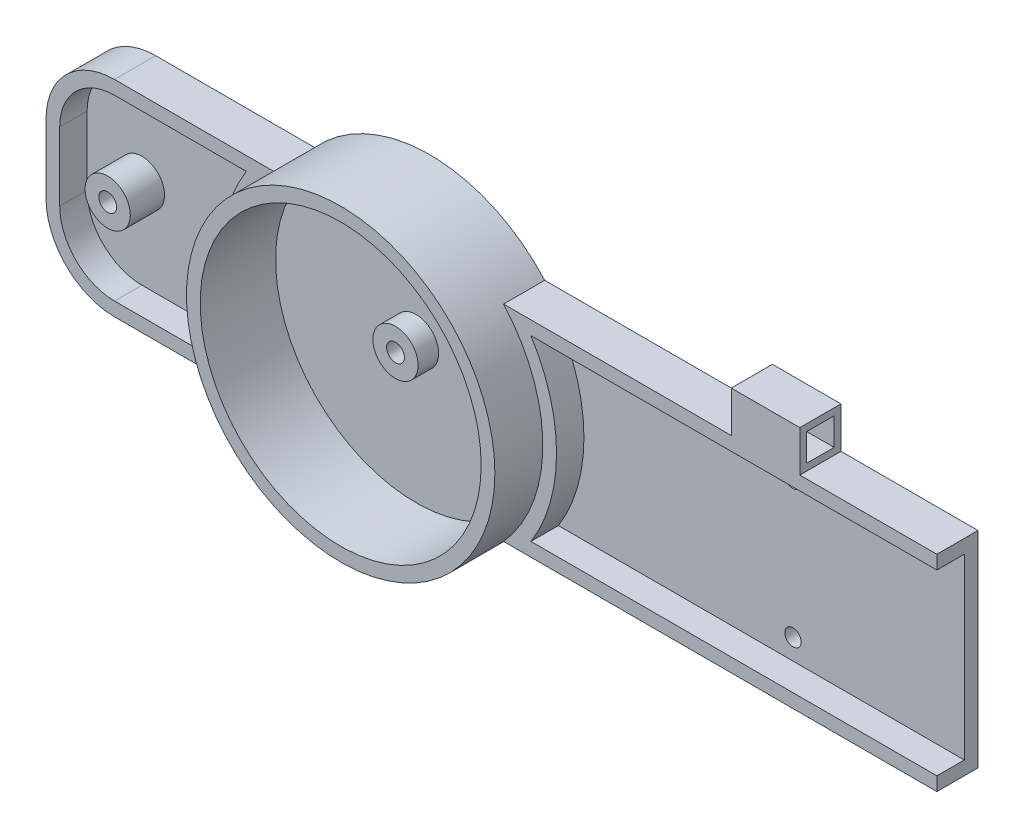
ISO-10303-21;
HEADER;
FILE_DESCRIPTION(('STEP AP214'),'2;1');
FILE_NAME('part.step','',(''),(''),'','','');
FILE_SCHEMA(('AUTOMOTIVE_DESIGN { 1 0 10303 214 1 1 1 1 }'));
ENDSEC;
DATA;
#1=APPLICATION_CONTEXT('core data for automotive mechanical design processes');
#2=APPLICATION_PROTOCOL_DEFINITION('international standard','automotive_design',2000,#1);
#3=PRODUCT_CONTEXT('',#1,'mechanical');
#4=PRODUCT('Part','Part','',(#3));
#5=PRODUCT_RELATED_PRODUCT_CATEGORY('part','',(#4));
#6=PRODUCT_DEFINITION_FORMATION('','',#4);
#7=PRODUCT_DEFINITION_CONTEXT('part definition',#1,'design');
#8=PRODUCT_DEFINITION('design','',#6,#7);
#9=PRODUCT_DEFINITION_SHAPE('','',#8);
#10=(LENGTH_UNIT() NAMED_UNIT(*) SI_UNIT(.MILLI.,.METRE.));
#11=(NAMED_UNIT(*) PLANE_ANGLE_UNIT() SI_UNIT($,.RADIAN.));
#12=(NAMED_UNIT(*) SI_UNIT($,.STERADIAN.) SOLID_ANGLE_UNIT());
#13=UNCERTAINTY_MEASURE_WITH_UNIT(LENGTH_MEASURE(1.E-05),#10,'distance_accuracy_value','');
#14=(GEOMETRIC_REPRESENTATION_CONTEXT(3) GLOBAL_UNCERTAINTY_ASSIGNED_CONTEXT((#13)) GLOBAL_UNIT_ASSIGNED_CONTEXT((#10,
#11,#12)) REPRESENTATION_CONTEXT('',''));
#15=CARTESIAN_POINT('',(0.,0.,0.));
#16=DIRECTION('',(0.,0.,1.));
#17=DIRECTION('',(1.,0.,0.));
#18=AXIS2_PLACEMENT_3D('',#15,#16,#17);
#19=CARTESIAN_POINT('',(-50.,15.,6.));
#20=DIRECTION('',(0.,-1.,0.));
#21=DIRECTION('',(0.,0.,-1.));
#22=AXIS2_PLACEMENT_3D('',#19,#20,#21);
#23=PLANE('',#22);
#24=DIRECTION('',(0.,0.,1.));
#25=VECTOR('',#24,1.);
#26=CARTESIAN_POINT('',(80.,15.,6.));
#27=LINE('',#26,#25);
#28=CARTESIAN_POINT('',(80.,15.,0.));
#29=VERTEX_POINT('',#28);
#30=CARTESIAN_POINT('',(80.,15.,6.));
#31=VERTEX_POINT('',#30);
#32=EDGE_CURVE('E61',#29,#31,#27,.T.);
#33=ORIENTED_EDGE('',*,*,#32,.F.);
#34=DIRECTION('',(-1.,0.,0.));
#35=VECTOR('',#34,1.);
#36=CARTESIAN_POINT('',(-50.,15.,0.));
#37=LINE('',#36,#35);
#38=CARTESIAN_POINT('',(60.,15.,0.));
#39=VERTEX_POINT('',#38);
#40=EDGE_CURVE('E447',#29,#39,#37,.T.);
#41=ORIENTED_EDGE('',*,*,#40,.T.);
#42=DIRECTION('',(0.,0.,-1.));
#43=VECTOR('',#42,1.);
#44=CARTESIAN_POINT('',(60.,15.,6.));
#45=LINE('',#44,#43);
#46=CARTESIAN_POINT('',(60.,15.,6.));
#47=VERTEX_POINT('',#46);
#48=EDGE_CURVE('E323',#47,#39,#45,.T.);
#49=ORIENTED_EDGE('',*,*,#48,.F.);
#50=DIRECTION('',(-1.,0.,0.));
#51=VECTOR('',#50,1.);
#52=CARTESIAN_POINT('',(-50.,15.,6.));
#53=LINE('',#52,#51);
#54=EDGE_CURVE('E437',#31,#47,#53,.T.);
#55=ORIENTED_EDGE('',*,*,#54,.F.);
#56=EDGE_LOOP('',(#33,#41,#49,#55));
#57=FACE_BOUND('',#56,.T.);
#58=ADVANCED_FACE('F46',(#57),#23,.F.);
#59=CARTESIAN_POINT('',(0.,0.,0.));
#60=DIRECTION('',(0.,0.,1.));
#61=DIRECTION('',(1.,0.,0.));
#62=AXIS2_PLACEMENT_3D('',#59,#60,#61);
#63=PLANE('',#62);
#64=CARTESIAN_POINT('',(0.,0.,0.));
#65=DIRECTION('',(0.,0.,-1.));
#66=DIRECTION('',(-1.,0.,0.));
#67=AXIS2_PLACEMENT_3D('',#64,#65,#66);
#68=CIRCLE('',#67,1.3);
#69=CARTESIAN_POINT('',(-1.3,0.,0.));
#70=VERTEX_POINT('',#69);
#71=EDGE_CURVE('E355',#70,#70,#68,.T.);
#72=ORIENTED_EDGE('',*,*,#71,.F.);
#73=EDGE_LOOP('',(#72));
#74=FACE_BOUND('',#73,.T.);
#75=CARTESIAN_POINT('',(-40.,0.,0.));
#76=DIRECTION('',(0.,0.,-1.));
#77=DIRECTION('',(-1.,0.,0.));
#78=AXIS2_PLACEMENT_3D('',#75,#76,#77);
#79=CIRCLE('',#78,1.29999999999999);
#80=CARTESIAN_POINT('',(-41.3,0.,0.));
#81=VERTEX_POINT('',#80);
#82=EDGE_CURVE('E344',#81,#81,#79,.T.);
#83=ORIENTED_EDGE('',*,*,#82,.F.);
#84=EDGE_LOOP('',(#83));
#85=FACE_BOUND('',#84,.T.);
#86=CARTESIAN_POINT('',(55.,10.,0.));
#87=DIRECTION('',(0.,0.,1.));
#88=DIRECTION('',(1.,0.,0.));
#89=AXIS2_PLACEMENT_3D('',#86,#87,#88);
#90=CIRCLE('',#89,1.2);
#91=CARTESIAN_POINT('',(56.2,10.,0.));
#92=VERTEX_POINT('',#91);
#93=EDGE_CURVE('E280',#92,#92,#90,.T.);
#94=ORIENTED_EDGE('',*,*,#93,.T.);
#95=EDGE_LOOP('',(#94));
#96=FACE_BOUND('',#95,.T.);
#97=CARTESIAN_POINT('',(55.,-10.,0.));
#98=DIRECTION('',(0.,0.,1.));
#99=DIRECTION('',(1.,0.,0.));
#100=AXIS2_PLACEMENT_3D('',#97,#98,#99);
#101=CIRCLE('',#100,1.2);
#102=CARTESIAN_POINT('',(56.2,-10.,0.));
#103=VERTEX_POINT('',#102);
#104=EDGE_CURVE('E271',#103,#103,#101,.T.);
#105=ORIENTED_EDGE('',*,*,#104,.T.);
#106=EDGE_LOOP('',(#105));
#107=FACE_BOUND('',#106,.T.);
#108=DIRECTION('',(0.,1.,0.));
#109=VECTOR('',#108,1.);
#110=CARTESIAN_POINT('',(80.,0.,0.));
#111=LINE('',#110,#109);
#112=CARTESIAN_POINT('',(80.,-15.,0.));
#113=VERTEX_POINT('',#112);
#114=EDGE_CURVE('E265',#113,#29,#111,.T.);
#115=ORIENTED_EDGE('',*,*,#114,.F.);
#116=DIRECTION('',(1.,0.,0.));
#117=VECTOR('',#116,1.);
#118=CARTESIAN_POINT('',(-50.,-15.,0.));
#119=LINE('',#118,#117);
#120=CARTESIAN_POINT('',(16.7705098312484,-15.,0.));
#121=VERTEX_POINT('',#120);
#122=EDGE_CURVE('E453',#121,#113,#119,.T.);
#123=ORIENTED_EDGE('',*,*,#122,.F.);
#124=CARTESIAN_POINT('',(0.,0.,0.));
#125=DIRECTION('',(0.,0.,1.));
#126=DIRECTION('',(1.,0.,0.));
#127=AXIS2_PLACEMENT_3D('',#124,#125,#126);
#128=CIRCLE('',#127,22.5);
#129=CARTESIAN_POINT('',(-16.7705098312484,-15.,0.));
#130=VERTEX_POINT('',#129);
#131=EDGE_CURVE('E467',#130,#121,#128,.T.);
#132=ORIENTED_EDGE('',*,*,#131,.F.);
#133=CARTESIAN_POINT('',(-40.,-15.,0.));
#134=VERTEX_POINT('',#133);
#135=EDGE_CURVE('E454',#134,#130,#119,.T.);
#136=ORIENTED_EDGE('',*,*,#135,.F.);
#137=CARTESIAN_POINT('',(-40.,-5.,0.));
#138=DIRECTION('',(0.,0.,1.));
#139=DIRECTION('',(1.,0.,0.));
#140=AXIS2_PLACEMENT_3D('',#137,#138,#139);
#141=CIRCLE('',#140,10.);
#142=CARTESIAN_POINT('',(-50.,-5.,0.));
#143=VERTEX_POINT('',#142);
#144=EDGE_CURVE('E482',#134,#143,#141,.F.);
#145=ORIENTED_EDGE('',*,*,#144,.T.);
#146=DIRECTION('',(0.,-1.,0.));
#147=VECTOR('',#146,1.);
#148=CARTESIAN_POINT('',(-50.,15.,0.));
#149=LINE('',#148,#147);
#150=CARTESIAN_POINT('',(-50.,5.,0.));
#151=VERTEX_POINT('',#150);
#152=EDGE_CURVE('E449',#151,#143,#149,.T.);
#153=ORIENTED_EDGE('',*,*,#152,.F.);
#154=CARTESIAN_POINT('',(-40.,5.,0.));
#155=DIRECTION('',(0.,0.,1.));
#156=DIRECTION('',(1.,0.,0.));
#157=AXIS2_PLACEMENT_3D('',#154,#155,#156);
#158=CIRCLE('',#157,10.);
#159=CARTESIAN_POINT('',(-40.,15.,0.));
#160=VERTEX_POINT('',#159);
#161=EDGE_CURVE('E480',#151,#160,#158,.F.);
#162=ORIENTED_EDGE('',*,*,#161,.T.);
#163=CARTESIAN_POINT('',(-16.7705098312484,15.,0.));
#164=VERTEX_POINT('',#163);
#165=EDGE_CURVE('E434',#164,#160,#37,.T.);
#166=ORIENTED_EDGE('',*,*,#165,.F.);
#167=CARTESIAN_POINT('',(16.7705098312484,15.,0.));
#168=VERTEX_POINT('',#167);
#169=EDGE_CURVE('E472',#168,#164,#128,.T.);
#170=ORIENTED_EDGE('',*,*,#169,.F.);
#171=CARTESIAN_POINT('',(50.,15.,0.));
#172=VERTEX_POINT('',#171);
#173=EDGE_CURVE('E450',#172,#168,#37,.T.);
#174=ORIENTED_EDGE('',*,*,#173,.F.);
#175=DIRECTION('',(0.,1.,0.));
#176=VECTOR('',#175,1.);
#177=CARTESIAN_POINT('',(50.,15.,0.));
#178=LINE('',#177,#176);
#179=CARTESIAN_POINT('',(50.,21.,0.));
#180=VERTEX_POINT('',#179);
#181=EDGE_CURVE('E319',#172,#180,#178,.T.);
#182=ORIENTED_EDGE('',*,*,#181,.T.);
#183=DIRECTION('',(1.,0.,0.));
#184=VECTOR('',#183,1.);
#185=CARTESIAN_POINT('',(50.,21.,0.));
#186=LINE('',#185,#184);
#187=CARTESIAN_POINT('',(60.,21.,0.));
#188=VERTEX_POINT('',#187);
#189=EDGE_CURVE('E331',#180,#188,#186,.T.);
#190=ORIENTED_EDGE('',*,*,#189,.T.);
#191=DIRECTION('',(0.,1.,0.));
#192=VECTOR('',#191,1.);
#193=CARTESIAN_POINT('',(60.,15.,0.));
#194=LINE('',#193,#192);
#195=EDGE_CURVE('E312',#39,#188,#194,.T.);
#196=ORIENTED_EDGE('',*,*,#195,.F.);
#197=ORIENTED_EDGE('',*,*,#40,.F.);
#198=EDGE_LOOP('',(#115,#123,#132,#136,#145,#153,#162,#166,#170,#174,#182,#190,#196,#197));
#199=FACE_BOUND('',#198,.T.);
#200=ADVANCED_FACE('F512',(#74,#85,#96,#107,#199),#63,.F.);
#201=CARTESIAN_POINT('',(0.,0.,2.));
#202=DIRECTION('',(0.,0.,1.));
#203=DIRECTION('',(1.,0.,0.));
#204=AXIS2_PLACEMENT_3D('',#201,#202,#203);
#205=PLANE('',#204);
#206=CARTESIAN_POINT('',(55.,10.,2.));
#207=DIRECTION('',(0.,0.,1.));
#208=DIRECTION('',(1.,0.,0.));
#209=AXIS2_PLACEMENT_3D('',#206,#207,#208);
#210=CIRCLE('',#209,1.19999999999999);
#211=CARTESIAN_POINT('',(56.2,10.,2.));
#212=VERTEX_POINT('',#211);
#213=EDGE_CURVE('E276',#212,#212,#210,.T.);
#214=ORIENTED_EDGE('',*,*,#213,.F.);
#215=EDGE_LOOP('',(#214));
#216=FACE_BOUND('',#215,.T.);
#217=CARTESIAN_POINT('',(55.,-10.,2.));
#218=DIRECTION('',(0.,0.,1.));
#219=DIRECTION('',(1.,0.,0.));
#220=AXIS2_PLACEMENT_3D('',#217,#218,#219);
#221=CIRCLE('',#220,1.19999999999999);
#222=CARTESIAN_POINT('',(56.2,-10.,2.));
#223=VERTEX_POINT('',#222);
#224=EDGE_CURVE('E268',#223,#223,#221,.T.);
#225=ORIENTED_EDGE('',*,*,#224,.F.);
#226=EDGE_LOOP('',(#225));
#227=FACE_BOUND('',#226,.T.);
#228=DIRECTION('',(1.,0.,0.));
#229=VECTOR('',#228,1.);
#230=CARTESIAN_POINT('',(20.7665596572952,-13.,2.));
#231=LINE('',#230,#229);
#232=CARTESIAN_POINT('',(20.7665596572952,-13.,2.));
#233=VERTEX_POINT('',#232);
#234=CARTESIAN_POINT('',(80.,-13.,2.));
#235=VERTEX_POINT('',#234);
#236=EDGE_CURVE('E373',#233,#235,#231,.T.);
#237=ORIENTED_EDGE('',*,*,#236,.T.);
#238=DIRECTION('',(0.,1.,0.));
#239=VECTOR('',#238,1.);
#240=CARTESIAN_POINT('',(80.,0.,2.));
#241=LINE('',#240,#239);
#242=CARTESIAN_POINT('',(80.,13.,2.));
#243=VERTEX_POINT('',#242);
#244=EDGE_CURVE('E251',#235,#243,#241,.T.);
#245=ORIENTED_EDGE('',*,*,#244,.T.);
#246=DIRECTION('',(-1.,0.,0.));
#247=VECTOR('',#246,1.);
#248=CARTESIAN_POINT('',(160.,13.,2.));
#249=LINE('',#248,#247);
#250=CARTESIAN_POINT('',(20.7665596572952,13.,2.));
#251=VERTEX_POINT('',#250);
#252=EDGE_CURVE('E375',#243,#251,#249,.T.);
#253=ORIENTED_EDGE('',*,*,#252,.T.);
#254=CARTESIAN_POINT('',(0.,0.,2.));
#255=DIRECTION('',(0.,0.,-1.));
#256=DIRECTION('',(1.,0.,0.));
#257=AXIS2_PLACEMENT_3D('',#254,#255,#256);
#258=CIRCLE('',#257,24.5);
#259=EDGE_CURVE('E370',#251,#233,#258,.T.);
#260=ORIENTED_EDGE('',*,*,#259,.T.);
#261=EDGE_LOOP('',(#237,#245,#253,#260));
#262=FACE_BOUND('',#261,.T.);
#263=ADVANCED_FACE('F557',(#216,#227,#262),#205,.T.);
#264=CARTESIAN_POINT('',(0.,0.,6.));
#265=DIRECTION('',(0.,0.,1.));
#266=DIRECTION('',(1.,0.,0.));
#267=AXIS2_PLACEMENT_3D('',#264,#265,#266);
#268=PLANE('',#267);
#269=DIRECTION('',(1.,0.,0.));
#270=VECTOR('',#269,1.);
#271=CARTESIAN_POINT('',(-50.,-15.,6.));
#272=LINE('',#271,#270);
#273=CARTESIAN_POINT('',(16.7705098312484,-15.,6.));
#274=VERTEX_POINT('',#273);
#275=CARTESIAN_POINT('',(80.,-15.,6.));
#276=VERTEX_POINT('',#275);
#277=EDGE_CURVE('E248',#274,#276,#272,.T.);
#278=ORIENTED_EDGE('',*,*,#277,.T.);
#279=DIRECTION('',(0.,1.,0.));
#280=VECTOR('',#279,1.);
#281=CARTESIAN_POINT('',(80.,0.,6.));
#282=LINE('',#281,#280);
#283=CARTESIAN_POINT('',(80.,-13.,6.));
#284=VERTEX_POINT('',#283);
#285=EDGE_CURVE('E244',#276,#284,#282,.T.);
#286=ORIENTED_EDGE('',*,*,#285,.T.);
#287=DIRECTION('',(1.,0.,0.));
#288=VECTOR('',#287,1.);
#289=CARTESIAN_POINT('',(20.7665596572952,-13.,6.));
#290=LINE('',#289,#288);
#291=CARTESIAN_POINT('',(20.7665596572952,-13.,6.));
#292=VERTEX_POINT('',#291);
#293=EDGE_CURVE('E232',#292,#284,#290,.T.);
#294=ORIENTED_EDGE('',*,*,#293,.F.);
#295=CARTESIAN_POINT('',(0.,0.,6.));
#296=DIRECTION('',(0.,0.,-1.));
#297=DIRECTION('',(1.,0.,0.));
#298=AXIS2_PLACEMENT_3D('',#295,#296,#297);
#299=CIRCLE('',#298,24.5);
#300=CARTESIAN_POINT('',(20.7665596572952,13.,6.));
#301=VERTEX_POINT('',#300);
#302=EDGE_CURVE('E240',#301,#292,#299,.T.);
#303=ORIENTED_EDGE('',*,*,#302,.F.);
#304=DIRECTION('',(-1.,0.,0.));
#305=VECTOR('',#304,1.);
#306=CARTESIAN_POINT('',(160.,13.,6.));
#307=LINE('',#306,#305);
#308=CARTESIAN_POINT('',(80.,13.,6.));
#309=VERTEX_POINT('',#308);
#310=EDGE_CURVE('E239',#309,#301,#307,.T.);
#311=ORIENTED_EDGE('',*,*,#310,.F.);
#312=EDGE_CURVE('E69',#309,#31,#282,.T.);
#313=ORIENTED_EDGE('',*,*,#312,.T.);
#314=ORIENTED_EDGE('',*,*,#54,.T.);
#315=DIRECTION('',(0.,-1.,0.));
#316=VECTOR('',#315,1.);
#317=CARTESIAN_POINT('',(60.,15.,6.));
#318=LINE('',#317,#316);
#319=CARTESIAN_POINT('',(60.,21.,6.));
#320=VERTEX_POINT('',#319);
#321=EDGE_CURVE('E337',#320,#47,#318,.T.);
#322=ORIENTED_EDGE('',*,*,#321,.F.);
#323=DIRECTION('',(1.,0.,0.));
#324=VECTOR('',#323,1.);
#325=CARTESIAN_POINT('',(50.,21.,6.));
#326=LINE('',#325,#324);
#327=CARTESIAN_POINT('',(50.,21.,6.));
#328=VERTEX_POINT('',#327);
#329=EDGE_CURVE('E342',#328,#320,#326,.T.);
#330=ORIENTED_EDGE('',*,*,#329,.F.);
#331=DIRECTION('',(0.,-1.,0.));
#332=VECTOR('',#331,1.);
#333=CARTESIAN_POINT('',(50.,15.,6.));
#334=LINE('',#333,#332);
#335=CARTESIAN_POINT('',(50.,15.,6.));
#336=VERTEX_POINT('',#335);
#337=EDGE_CURVE('E326',#328,#336,#334,.T.);
#338=ORIENTED_EDGE('',*,*,#337,.T.);
#339=CARTESIAN_POINT('',(16.7705098312484,15.,6.));
#340=VERTEX_POINT('',#339);
#341=EDGE_CURVE('E440',#336,#340,#53,.T.);
#342=ORIENTED_EDGE('',*,*,#341,.T.);
#343=CARTESIAN_POINT('',(0.,0.,6.));
#344=DIRECTION('',(0.,0.,1.));
#345=DIRECTION('',(1.,0.,0.));
#346=AXIS2_PLACEMENT_3D('',#343,#344,#345);
#347=CIRCLE('',#346,22.5);
#348=EDGE_CURVE('E471',#274,#340,#347,.T.);
#349=ORIENTED_EDGE('',*,*,#348,.F.);
#350=EDGE_LOOP('',(#278,#286,#294,#303,#311,#313,#314,#322,#330,#338,#342,#349));
#351=FACE_BOUND('',#350,.T.);
#352=ADVANCED_FACE('F245',(#351),#268,.T.);
#353=CARTESIAN_POINT('',(-50.,-15.,6.));
#354=DIRECTION('',(0.,1.,0.));
#355=DIRECTION('',(0.,0.,1.));
#356=AXIS2_PLACEMENT_3D('',#353,#354,#355);
#357=PLANE('',#356);
#358=DIRECTION('',(0.,0.,-1.));
#359=VECTOR('',#358,1.);
#360=CARTESIAN_POINT('',(80.,-15.,6.));
#361=LINE('',#360,#359);
#362=EDGE_CURVE('E261',#276,#113,#361,.T.);
#363=ORIENTED_EDGE('',*,*,#362,.F.);
#364=ORIENTED_EDGE('',*,*,#277,.F.);
#365=DIRECTION('',(0.,0.,-1.));
#366=VECTOR('',#365,1.);
#367=CARTESIAN_POINT('',(16.7705098312484,-15.,13.));
#368=LINE('',#367,#366);
#369=EDGE_CURVE('E458',#274,#121,#368,.T.);
#370=ORIENTED_EDGE('',*,*,#369,.T.);
#371=ORIENTED_EDGE('',*,*,#122,.T.);
#372=EDGE_LOOP('',(#363,#364,#370,#371));
#373=FACE_BOUND('',#372,.T.);
#374=ADVANCED_FACE('F547',(#373),#357,.F.);
#375=CARTESIAN_POINT('',(160.,13.,2.));
#376=DIRECTION('',(0.,1.,0.));
#377=DIRECTION('',(-1.,0.,0.));
#378=AXIS2_PLACEMENT_3D('',#375,#376,#377);
#379=PLANE('',#378);
#380=DIRECTION('',(0.,0.,-1.));
#381=VECTOR('',#380,1.);
#382=CARTESIAN_POINT('',(80.,13.,2.));
#383=LINE('',#382,#381);
#384=EDGE_CURVE('E257',#309,#243,#383,.T.);
#385=ORIENTED_EDGE('',*,*,#384,.F.);
#386=ORIENTED_EDGE('',*,*,#310,.T.);
#387=DIRECTION('',(0.,0.,1.));
#388=VECTOR('',#387,1.);
#389=CARTESIAN_POINT('',(20.7665596572952,13.,2.));
#390=LINE('',#389,#388);
#391=EDGE_CURVE('E380',#251,#301,#390,.T.);
#392=ORIENTED_EDGE('',*,*,#391,.F.);
#393=ORIENTED_EDGE('',*,*,#252,.F.);
#394=EDGE_LOOP('',(#385,#386,#392,#393));
#395=FACE_BOUND('',#394,.T.);
#396=ADVANCED_FACE('F549',(#395),#379,.F.);
#397=CARTESIAN_POINT('',(20.7665596572952,-13.,2.));
#398=DIRECTION('',(0.,-1.,0.));
#399=DIRECTION('',(0.,0.,-1.));
#400=AXIS2_PLACEMENT_3D('',#397,#398,#399);
#401=PLANE('',#400);
#402=DIRECTION('',(0.,0.,1.));
#403=VECTOR('',#402,1.);
#404=CARTESIAN_POINT('',(80.,-13.,2.));
#405=LINE('',#404,#403);
#406=EDGE_CURVE('E13',#235,#284,#405,.T.);
#407=ORIENTED_EDGE('',*,*,#406,.F.);
#408=ORIENTED_EDGE('',*,*,#236,.F.);
#409=DIRECTION('',(0.,0.,1.));
#410=VECTOR('',#409,1.);
#411=CARTESIAN_POINT('',(20.7665596572952,-13.,2.));
#412=LINE('',#411,#410);
#413=EDGE_CURVE('E237',#233,#292,#412,.T.);
#414=ORIENTED_EDGE('',*,*,#413,.T.);
#415=ORIENTED_EDGE('',*,*,#293,.T.);
#416=EDGE_LOOP('',(#407,#408,#414,#415));
#417=FACE_BOUND('',#416,.T.);
#418=ADVANCED_FACE('F234',(#417),#401,.F.);
#419=CARTESIAN_POINT('',(0.,0.,13.));
#420=DIRECTION('',(0.,0.,-1.));
#421=DIRECTION('',(-1.,0.,0.));
#422=AXIS2_PLACEMENT_3D('',#419,#420,#421);
#423=CYLINDRICAL_SURFACE('',#422,22.5);
#424=CARTESIAN_POINT('',(0.,0.,13.));
#425=DIRECTION('',(0.,0.,1.));
#426=DIRECTION('',(1.,0.,0.));
#427=AXIS2_PLACEMENT_3D('',#424,#425,#426);
#428=CIRCLE('',#427,22.5);
#429=CARTESIAN_POINT('',(22.5,0.,13.));
#430=VERTEX_POINT('',#429);
#431=EDGE_CURVE('E468',#430,#430,#428,.T.);
#432=ORIENTED_EDGE('',*,*,#431,.F.);
#433=EDGE_LOOP('',(#432));
#434=FACE_BOUND('',#433,.T.);
#435=DIRECTION('',(0.,0.,-1.));
#436=VECTOR('',#435,1.);
#437=CARTESIAN_POINT('',(-16.7705098312484,15.,13.));
#438=LINE('',#437,#436);
#439=CARTESIAN_POINT('',(-16.7705098312484,15.,6.));
#440=VERTEX_POINT('',#439);
#441=EDGE_CURVE('E464',#440,#164,#438,.T.);
#442=ORIENTED_EDGE('',*,*,#441,.F.);
#443=CARTESIAN_POINT('',(-16.7705098312484,-15.,6.));
#444=VERTEX_POINT('',#443);
#445=EDGE_CURVE('E476',#440,#444,#347,.T.);
#446=ORIENTED_EDGE('',*,*,#445,.T.);
#447=DIRECTION('',(0.,0.,-1.));
#448=VECTOR('',#447,1.);
#449=CARTESIAN_POINT('',(-16.7705098312484,-15.,13.));
#450=LINE('',#449,#448);
#451=EDGE_CURVE('E446',#130,#444,#450,.F.);
#452=ORIENTED_EDGE('',*,*,#451,.F.);
#453=ORIENTED_EDGE('',*,*,#131,.T.);
#454=ORIENTED_EDGE('',*,*,#369,.F.);
#455=ORIENTED_EDGE('',*,*,#348,.T.);
#456=DIRECTION('',(0.,0.,-1.));
#457=VECTOR('',#456,1.);
#458=CARTESIAN_POINT('',(16.7705098312484,15.,13.));
#459=LINE('',#458,#457);
#460=EDGE_CURVE('E461',#168,#340,#459,.F.);
#461=ORIENTED_EDGE('',*,*,#460,.F.);
#462=ORIENTED_EDGE('',*,*,#169,.T.);
#463=EDGE_LOOP('',(#442,#446,#452,#453,#454,#455,#461,#462));
#464=FACE_BOUND('',#463,.T.);
#465=ADVANCED_FACE('F524',(#434,#464),#423,.T.);
#466=CARTESIAN_POINT('',(0.,0.,13.));
#467=DIRECTION('',(0.,0.,1.));
#468=DIRECTION('',(1.,0.,0.));
#469=AXIS2_PLACEMENT_3D('',#466,#467,#468);
#470=PLANE('',#469);
#471=CARTESIAN_POINT('',(0.,0.,13.));
#472=DIRECTION('',(0.,0.,1.));
#473=DIRECTION('',(1.,0.,0.));
#474=AXIS2_PLACEMENT_3D('',#471,#472,#473);
#475=CIRCLE('',#474,20.5);
#476=CARTESIAN_POINT('',(20.5,0.,13.));
#477=VERTEX_POINT('',#476);
#478=EDGE_CURVE('E383',#477,#477,#475,.T.);
#479=ORIENTED_EDGE('',*,*,#478,.F.);
#480=EDGE_LOOP('',(#479));
#481=FACE_BOUND('',#480,.T.);
#482=ORIENTED_EDGE('',*,*,#431,.T.);
#483=EDGE_LOOP('',(#482));
#484=FACE_BOUND('',#483,.T.);
#485=ADVANCED_FACE('F570',(#481,#484),#470,.T.);
#486=ORIENTED_EDGE('',*,*,#341,.F.);
#487=DIRECTION('',(0.,0.,-1.));
#488=VECTOR('',#487,1.);
#489=CARTESIAN_POINT('',(50.,15.,6.));
#490=LINE('',#489,#488);
#491=EDGE_CURVE('E329',#336,#172,#490,.T.);
#492=ORIENTED_EDGE('',*,*,#491,.T.);
#493=ORIENTED_EDGE('',*,*,#173,.T.);
#494=ORIENTED_EDGE('',*,*,#460,.T.);
#495=EDGE_LOOP('',(#486,#492,#493,#494));
#496=FACE_BOUND('',#495,.T.);
#497=ADVANCED_FACE('F529',(#496),#23,.F.);
#498=CARTESIAN_POINT('',(0.,0.,6.));
#499=DIRECTION('',(0.,0.,-1.));
#500=DIRECTION('',(1.,0.,0.));
#501=AXIS2_PLACEMENT_3D('',#498,#499,#500);
#502=CIRCLE('',#501,24.5);
#503=CARTESIAN_POINT('',(-20.7665596572952,-13.,6.));
#504=VERTEX_POINT('',#503);
#505=CARTESIAN_POINT('',(-20.7665596572952,13.,6.));
#506=VERTEX_POINT('',#505);
#507=EDGE_CURVE('E367',#504,#506,#502,.T.);
#508=ORIENTED_EDGE('',*,*,#507,.F.);
#509=DIRECTION('',(1.,0.,0.));
#510=VECTOR('',#509,1.);
#511=CARTESIAN_POINT('',(-40.,-13.,6.));
#512=LINE('',#511,#510);
#513=CARTESIAN_POINT('',(-40.,-13.,6.));
#514=VERTEX_POINT('',#513);
#515=EDGE_CURVE('E389',#514,#504,#512,.T.);
#516=ORIENTED_EDGE('',*,*,#515,.F.);
#517=CARTESIAN_POINT('',(-40.,-5.,6.));
#518=DIRECTION('',(0.,0.,1.));
#519=DIRECTION('',(1.,0.,0.));
#520=AXIS2_PLACEMENT_3D('',#517,#518,#519);
#521=CIRCLE('',#520,8.);
#522=CARTESIAN_POINT('',(-48.,-5.,6.));
#523=VERTEX_POINT('',#522);
#524=EDGE_CURVE('E415',#523,#514,#521,.T.);
#525=ORIENTED_EDGE('',*,*,#524,.F.);
#526=DIRECTION('',(0.,-1.,0.));
#527=VECTOR('',#526,1.);
#528=CARTESIAN_POINT('',(-48.,5.,6.));
#529=LINE('',#528,#527);
#530=CARTESIAN_POINT('',(-48.,5.,6.));
#531=VERTEX_POINT('',#530);
#532=EDGE_CURVE('E412',#531,#523,#529,.T.);
#533=ORIENTED_EDGE('',*,*,#532,.F.);
#534=CARTESIAN_POINT('',(-40.,5.,6.));
#535=DIRECTION('',(0.,0.,1.));
#536=DIRECTION('',(1.,0.,0.));
#537=AXIS2_PLACEMENT_3D('',#534,#535,#536);
#538=CIRCLE('',#537,8.);
#539=CARTESIAN_POINT('',(-40.,13.,6.));
#540=VERTEX_POINT('',#539);
#541=EDGE_CURVE('E409',#540,#531,#538,.T.);
#542=ORIENTED_EDGE('',*,*,#541,.F.);
#543=DIRECTION('',(-1.,0.,0.));
#544=VECTOR('',#543,1.);
#545=CARTESIAN_POINT('',(-20.7665596572952,13.,6.));
#546=LINE('',#545,#544);
#547=EDGE_CURVE('E406',#506,#540,#546,.T.);
#548=ORIENTED_EDGE('',*,*,#547,.F.);
#549=EDGE_LOOP('',(#508,#516,#525,#533,#542,#548));
#550=FACE_BOUND('',#549,.T.);
#551=DIRECTION('',(0.,-1.,0.));
#552=VECTOR('',#551,1.);
#553=CARTESIAN_POINT('',(-50.,15.,6.));
#554=LINE('',#553,#552);
#555=CARTESIAN_POINT('',(-50.,5.,6.));
#556=VERTEX_POINT('',#555);
#557=CARTESIAN_POINT('',(-50.,-5.,6.));
#558=VERTEX_POINT('',#557);
#559=EDGE_CURVE('E439',#556,#558,#554,.T.);
#560=ORIENTED_EDGE('',*,*,#559,.T.);
#561=CARTESIAN_POINT('',(-40.,-5.,6.));
#562=DIRECTION('',(0.,0.,1.));
#563=DIRECTION('',(1.,0.,0.));
#564=AXIS2_PLACEMENT_3D('',#561,#562,#563);
#565=CIRCLE('',#564,10.);
#566=CARTESIAN_POINT('',(-40.,-15.,6.));
#567=VERTEX_POINT('',#566);
#568=EDGE_CURVE('E491',#558,#567,#565,.T.);
#569=ORIENTED_EDGE('',*,*,#568,.T.);
#570=EDGE_CURVE('E444',#567,#444,#272,.T.);
#571=ORIENTED_EDGE('',*,*,#570,.T.);
#572=ORIENTED_EDGE('',*,*,#445,.F.);
#573=CARTESIAN_POINT('',(-40.,15.,6.));
#574=VERTEX_POINT('',#573);
#575=EDGE_CURVE('E441',#440,#574,#53,.T.);
#576=ORIENTED_EDGE('',*,*,#575,.T.);
#577=CARTESIAN_POINT('',(-40.,5.,6.));
#578=DIRECTION('',(0.,0.,1.));
#579=DIRECTION('',(1.,0.,0.));
#580=AXIS2_PLACEMENT_3D('',#577,#578,#579);
#581=CIRCLE('',#580,10.);
#582=EDGE_CURVE('E489',#574,#556,#581,.T.);
#583=ORIENTED_EDGE('',*,*,#582,.T.);
#584=EDGE_LOOP('',(#560,#569,#571,#572,#576,#583));
#585=FACE_BOUND('',#584,.T.);
#586=ADVANCED_FACE('F503',(#550,#585),#268,.T.);
#587=ORIENTED_EDGE('',*,*,#165,.T.);
#588=DIRECTION('',(0.,0.,-1.));
#589=VECTOR('',#588,1.);
#590=CARTESIAN_POINT('',(-40.,15.,6.));
#591=LINE('',#590,#589);
#592=EDGE_CURVE('E54',#160,#574,#591,.F.);
#593=ORIENTED_EDGE('',*,*,#592,.T.);
#594=ORIENTED_EDGE('',*,*,#575,.F.);
#595=ORIENTED_EDGE('',*,*,#441,.T.);
#596=EDGE_LOOP('',(#587,#593,#594,#595));
#597=FACE_BOUND('',#596,.T.);
#598=ADVANCED_FACE('F497',(#597),#23,.F.);
#599=ORIENTED_EDGE('',*,*,#570,.F.);
#600=DIRECTION('',(0.,0.,-1.));
#601=VECTOR('',#600,1.);
#602=CARTESIAN_POINT('',(-40.,-15.,6.));
#603=LINE('',#602,#601);
#604=EDGE_CURVE('E477',#567,#134,#603,.T.);
#605=ORIENTED_EDGE('',*,*,#604,.T.);
#606=ORIENTED_EDGE('',*,*,#135,.T.);
#607=ORIENTED_EDGE('',*,*,#451,.T.);
#608=EDGE_LOOP('',(#599,#605,#606,#607));
#609=FACE_BOUND('',#608,.T.);
#610=ADVANCED_FACE('F521',(#609),#357,.F.);
#611=CARTESIAN_POINT('',(-50.,15.,6.));
#612=DIRECTION('',(1.,0.,0.));
#613=DIRECTION('',(0.,1.,0.));
#614=AXIS2_PLACEMENT_3D('',#611,#612,#613);
#615=PLANE('',#614);
#616=ORIENTED_EDGE('',*,*,#152,.T.);
#617=DIRECTION('',(0.,0.,-1.));
#618=VECTOR('',#617,1.);
#619=CARTESIAN_POINT('',(-50.,-5.,6.));
#620=LINE('',#619,#618);
#621=EDGE_CURVE('E487',#143,#558,#620,.F.);
#622=ORIENTED_EDGE('',*,*,#621,.T.);
#623=ORIENTED_EDGE('',*,*,#559,.F.);
#624=DIRECTION('',(0.,0.,-1.));
#625=VECTOR('',#624,1.);
#626=CARTESIAN_POINT('',(-50.,5.,6.));
#627=LINE('',#626,#625);
#628=EDGE_CURVE('E484',#556,#151,#627,.T.);
#629=ORIENTED_EDGE('',*,*,#628,.T.);
#630=EDGE_LOOP('',(#616,#622,#623,#629));
#631=FACE_BOUND('',#630,.T.);
#632=ADVANCED_FACE('F509',(#631),#615,.F.);
#633=CARTESIAN_POINT('',(-40.,-5.,6.));
#634=DIRECTION('',(0.,0.,-1.));
#635=DIRECTION('',(-1.,0.,0.));
#636=AXIS2_PLACEMENT_3D('',#633,#634,#635);
#637=CYLINDRICAL_SURFACE('',#636,10.);
#638=ORIENTED_EDGE('',*,*,#568,.F.);
#639=ORIENTED_EDGE('',*,*,#621,.F.);
#640=ORIENTED_EDGE('',*,*,#144,.F.);
#641=ORIENTED_EDGE('',*,*,#604,.F.);
#642=EDGE_LOOP('',(#638,#639,#640,#641));
#643=FACE_BOUND('',#642,.T.);
#644=ADVANCED_FACE('F518',(#643),#637,.T.);
#645=CARTESIAN_POINT('',(-40.,5.,6.));
#646=DIRECTION('',(0.,0.,-1.));
#647=DIRECTION('',(-1.,0.,0.));
#648=AXIS2_PLACEMENT_3D('',#645,#646,#647);
#649=CYLINDRICAL_SURFACE('',#648,10.);
#650=ORIENTED_EDGE('',*,*,#582,.F.);
#651=ORIENTED_EDGE('',*,*,#592,.F.);
#652=ORIENTED_EDGE('',*,*,#161,.F.);
#653=ORIENTED_EDGE('',*,*,#628,.F.);
#654=EDGE_LOOP('',(#650,#651,#652,#653));
#655=FACE_BOUND('',#654,.T.);
#656=ADVANCED_FACE('F48',(#655),#649,.T.);
#657=CARTESIAN_POINT('',(0.,0.,2.));
#658=DIRECTION('',(0.,0.,1.));
#659=DIRECTION('',(1.,0.,0.));
#660=AXIS2_PLACEMENT_3D('',#657,#658,#659);
#661=CYLINDRICAL_SURFACE('',#660,20.5);
#662=CARTESIAN_POINT('',(0.,0.,2.));
#663=DIRECTION('',(0.,0.,1.));
#664=DIRECTION('',(1.,0.,0.));
#665=AXIS2_PLACEMENT_3D('',#662,#663,#664);
#666=CIRCLE('',#665,20.5);
#667=CARTESIAN_POINT('',(20.5,0.,2.));
#668=VERTEX_POINT('',#667);
#669=EDGE_CURVE('E431',#668,#668,#666,.T.);
#670=ORIENTED_EDGE('',*,*,#669,.F.);
#671=EDGE_LOOP('',(#670));
#672=FACE_BOUND('',#671,.T.);
#673=ORIENTED_EDGE('',*,*,#478,.T.);
#674=EDGE_LOOP('',(#673));
#675=FACE_BOUND('',#674,.T.);
#676=ADVANCED_FACE('F580',(#672,#675),#661,.F.);
#677=CARTESIAN_POINT('',(0.,0.,2.));
#678=DIRECTION('',(0.,0.,1.));
#679=DIRECTION('',(1.,0.,0.));
#680=AXIS2_PLACEMENT_3D('',#677,#678,#679);
#681=PLANE('',#680);
#682=CARTESIAN_POINT('',(0.,0.,2.));
#683=DIRECTION('',(0.,0.,1.));
#684=DIRECTION('',(1.,0.,0.));
#685=AXIS2_PLACEMENT_3D('',#682,#683,#684);
#686=CIRCLE('',#685,3.3);
#687=CARTESIAN_POINT('',(3.3,0.,2.));
#688=VERTEX_POINT('',#687);
#689=EDGE_CURVE('E363',#688,#688,#686,.T.);
#690=ORIENTED_EDGE('',*,*,#689,.F.);
#691=EDGE_LOOP('',(#690));
#692=FACE_BOUND('',#691,.T.);
#693=ORIENTED_EDGE('',*,*,#669,.T.);
#694=EDGE_LOOP('',(#693));
#695=FACE_BOUND('',#694,.T.);
#696=ADVANCED_FACE('F583',(#692,#695),#681,.T.);
#697=CARTESIAN_POINT('',(0.,0.,2.));
#698=DIRECTION('',(0.,0.,1.));
#699=DIRECTION('',(1.,0.,0.));
#700=AXIS2_PLACEMENT_3D('',#697,#698,#699);
#701=CYLINDRICAL_SURFACE('',#700,24.5);
#702=ORIENTED_EDGE('',*,*,#507,.T.);
#703=DIRECTION('',(0.,0.,1.));
#704=VECTOR('',#703,1.);
#705=CARTESIAN_POINT('',(-20.7665596572952,13.,2.));
#706=LINE('',#705,#704);
#707=CARTESIAN_POINT('',(-20.7665596572952,13.,2.));
#708=VERTEX_POINT('',#707);
#709=EDGE_CURVE('E404',#708,#506,#706,.T.);
#710=ORIENTED_EDGE('',*,*,#709,.F.);
#711=CARTESIAN_POINT('',(0.,0.,2.));
#712=DIRECTION('',(0.,0.,-1.));
#713=DIRECTION('',(1.,0.,0.));
#714=AXIS2_PLACEMENT_3D('',#711,#712,#713);
#715=CIRCLE('',#714,24.5);
#716=CARTESIAN_POINT('',(-20.7665596572952,-13.,2.));
#717=VERTEX_POINT('',#716);
#718=EDGE_CURVE('E385',#717,#708,#715,.T.);
#719=ORIENTED_EDGE('',*,*,#718,.F.);
#720=DIRECTION('',(0.,0.,1.));
#721=VECTOR('',#720,1.);
#722=CARTESIAN_POINT('',(-20.7665596572952,-13.,2.));
#723=LINE('',#722,#721);
#724=EDGE_CURVE('E377',#717,#504,#723,.T.);
#725=ORIENTED_EDGE('',*,*,#724,.T.);
#726=EDGE_LOOP('',(#702,#710,#719,#725));
#727=FACE_BOUND('',#726,.T.);
#728=ADVANCED_FACE('F587',(#727),#701,.T.);
#729=CARTESIAN_POINT('',(-40.,-13.,2.));
#730=DIRECTION('',(0.,-1.,0.));
#731=DIRECTION('',(1.,0.,0.));
#732=AXIS2_PLACEMENT_3D('',#729,#730,#731);
#733=PLANE('',#732);
#734=ORIENTED_EDGE('',*,*,#515,.T.);
#735=ORIENTED_EDGE('',*,*,#724,.F.);
#736=DIRECTION('',(1.,0.,0.));
#737=VECTOR('',#736,1.);
#738=CARTESIAN_POINT('',(-40.,-13.,2.));
#739=LINE('',#738,#737);
#740=CARTESIAN_POINT('',(-40.,-13.,2.));
#741=VERTEX_POINT('',#740);
#742=EDGE_CURVE('E401',#741,#717,#739,.T.);
#743=ORIENTED_EDGE('',*,*,#742,.F.);
#744=DIRECTION('',(0.,0.,1.));
#745=VECTOR('',#744,1.);
#746=CARTESIAN_POINT('',(-40.,-13.,2.));
#747=LINE('',#746,#745);
#748=EDGE_CURVE('E421',#741,#514,#747,.T.);
#749=ORIENTED_EDGE('',*,*,#748,.T.);
#750=EDGE_LOOP('',(#734,#735,#743,#749));
#751=FACE_BOUND('',#750,.T.);
#752=ADVANCED_FACE('F591',(#751),#733,.F.);
#753=CARTESIAN_POINT('',(-40.,-5.,2.));
#754=DIRECTION('',(0.,0.,1.));
#755=DIRECTION('',(1.,0.,0.));
#756=AXIS2_PLACEMENT_3D('',#753,#754,#755);
#757=CYLINDRICAL_SURFACE('',#756,8.);
#758=ORIENTED_EDGE('',*,*,#524,.T.);
#759=ORIENTED_EDGE('',*,*,#748,.F.);
#760=CARTESIAN_POINT('',(-40.,-5.,2.));
#761=DIRECTION('',(0.,0.,1.));
#762=DIRECTION('',(1.,0.,0.));
#763=AXIS2_PLACEMENT_3D('',#760,#761,#762);
#764=CIRCLE('',#763,8.);
#765=CARTESIAN_POINT('',(-48.,-5.,2.));
#766=VERTEX_POINT('',#765);
#767=EDGE_CURVE('E398',#766,#741,#764,.T.);
#768=ORIENTED_EDGE('',*,*,#767,.F.);
#769=DIRECTION('',(0.,0.,1.));
#770=VECTOR('',#769,1.);
#771=CARTESIAN_POINT('',(-48.,-5.,2.));
#772=LINE('',#771,#770);
#773=EDGE_CURVE('E423',#766,#523,#772,.T.);
#774=ORIENTED_EDGE('',*,*,#773,.T.);
#775=EDGE_LOOP('',(#758,#759,#768,#774));
#776=FACE_BOUND('',#775,.T.);
#777=ADVANCED_FACE('F605',(#776),#757,.F.);
#778=CARTESIAN_POINT('',(-48.,5.,2.));
#779=DIRECTION('',(-1.,0.,0.));
#780=DIRECTION('',(0.,-1.,0.));
#781=AXIS2_PLACEMENT_3D('',#778,#779,#780);
#782=PLANE('',#781);
#783=ORIENTED_EDGE('',*,*,#532,.T.);
#784=ORIENTED_EDGE('',*,*,#773,.F.);
#785=DIRECTION('',(0.,-1.,0.));
#786=VECTOR('',#785,1.);
#787=CARTESIAN_POINT('',(-48.,5.,2.));
#788=LINE('',#787,#786);
#789=CARTESIAN_POINT('',(-48.,5.,2.));
#790=VERTEX_POINT('',#789);
#791=EDGE_CURVE('E395',#790,#766,#788,.T.);
#792=ORIENTED_EDGE('',*,*,#791,.F.);
#793=DIRECTION('',(0.,0.,1.));
#794=VECTOR('',#793,1.);
#795=CARTESIAN_POINT('',(-48.,5.,2.));
#796=LINE('',#795,#794);
#797=EDGE_CURVE('E425',#790,#531,#796,.T.);
#798=ORIENTED_EDGE('',*,*,#797,.T.);
#799=EDGE_LOOP('',(#783,#784,#792,#798));
#800=FACE_BOUND('',#799,.T.);
#801=ADVANCED_FACE('F601',(#800),#782,.F.);
#802=CARTESIAN_POINT('',(-40.,5.,2.));
#803=DIRECTION('',(0.,0.,1.));
#804=DIRECTION('',(1.,0.,0.));
#805=AXIS2_PLACEMENT_3D('',#802,#803,#804);
#806=CYLINDRICAL_SURFACE('',#805,8.);
#807=ORIENTED_EDGE('',*,*,#541,.T.);
#808=ORIENTED_EDGE('',*,*,#797,.F.);
#809=CARTESIAN_POINT('',(-40.,5.,2.));
#810=DIRECTION('',(0.,0.,1.));
#811=DIRECTION('',(1.,0.,0.));
#812=AXIS2_PLACEMENT_3D('',#809,#810,#811);
#813=CIRCLE('',#812,8.);
#814=CARTESIAN_POINT('',(-40.,13.,2.));
#815=VERTEX_POINT('',#814);
#816=EDGE_CURVE('E392',#815,#790,#813,.T.);
#817=ORIENTED_EDGE('',*,*,#816,.F.);
#818=DIRECTION('',(0.,0.,1.));
#819=VECTOR('',#818,1.);
#820=CARTESIAN_POINT('',(-40.,13.,2.));
#821=LINE('',#820,#819);
#822=EDGE_CURVE('E427',#815,#540,#821,.T.);
#823=ORIENTED_EDGE('',*,*,#822,.T.);
#824=EDGE_LOOP('',(#807,#808,#817,#823));
#825=FACE_BOUND('',#824,.T.);
#826=ADVANCED_FACE('F597',(#825),#806,.F.);
#827=CARTESIAN_POINT('',(-20.7665596572952,13.,2.));
#828=DIRECTION('',(0.,1.,0.));
#829=DIRECTION('',(0.,0.,1.));
#830=AXIS2_PLACEMENT_3D('',#827,#828,#829);
#831=PLANE('',#830);
#832=ORIENTED_EDGE('',*,*,#547,.T.);
#833=ORIENTED_EDGE('',*,*,#822,.F.);
#834=DIRECTION('',(-1.,0.,0.));
#835=VECTOR('',#834,1.);
#836=CARTESIAN_POINT('',(-20.7665596572952,13.,2.));
#837=LINE('',#836,#835);
#838=EDGE_CURVE('E388',#708,#815,#837,.T.);
#839=ORIENTED_EDGE('',*,*,#838,.F.);
#840=ORIENTED_EDGE('',*,*,#709,.T.);
#841=EDGE_LOOP('',(#832,#833,#839,#840));
#842=FACE_BOUND('',#841,.T.);
#843=ADVANCED_FACE('F593',(#842),#831,.F.);
#844=CARTESIAN_POINT('',(0.,0.,2.));
#845=DIRECTION('',(0.,0.,1.));
#846=DIRECTION('',(1.,0.,0.));
#847=AXIS2_PLACEMENT_3D('',#844,#845,#846);
#848=PLANE('',#847);
#849=CARTESIAN_POINT('',(-40.,0.,2.));
#850=DIRECTION('',(0.,0.,1.));
#851=DIRECTION('',(1.,0.,0.));
#852=AXIS2_PLACEMENT_3D('',#849,#850,#851);
#853=CIRCLE('',#852,3.3);
#854=CARTESIAN_POINT('',(-36.7,0.,2.));
#855=VERTEX_POINT('',#854);
#856=EDGE_CURVE('E351',#855,#855,#853,.T.);
#857=ORIENTED_EDGE('',*,*,#856,.F.);
#858=EDGE_LOOP('',(#857));
#859=FACE_BOUND('',#858,.T.);
#860=ORIENTED_EDGE('',*,*,#718,.T.);
#861=ORIENTED_EDGE('',*,*,#838,.T.);
#862=ORIENTED_EDGE('',*,*,#816,.T.);
#863=ORIENTED_EDGE('',*,*,#791,.T.);
#864=ORIENTED_EDGE('',*,*,#767,.T.);
#865=ORIENTED_EDGE('',*,*,#742,.T.);
#866=EDGE_LOOP('',(#860,#861,#862,#863,#864,#865));
#867=FACE_BOUND('',#866,.T.);
#868=ADVANCED_FACE('F596',(#859,#867),#848,.T.);
#869=CARTESIAN_POINT('',(0.,0.,2.));
#870=DIRECTION('',(0.,0.,1.));
#871=DIRECTION('',(1.,0.,0.));
#872=AXIS2_PLACEMENT_3D('',#869,#870,#871);
#873=CYLINDRICAL_SURFACE('',#872,24.5);
#874=ORIENTED_EDGE('',*,*,#302,.T.);
#875=ORIENTED_EDGE('',*,*,#413,.F.);
#876=ORIENTED_EDGE('',*,*,#259,.F.);
#877=ORIENTED_EDGE('',*,*,#391,.T.);
#878=EDGE_LOOP('',(#874,#875,#876,#877));
#879=FACE_BOUND('',#878,.T.);
#880=ADVANCED_FACE('F615',(#879),#873,.T.);
#881=CARTESIAN_POINT('',(0.,0.,5.));
#882=DIRECTION('',(0.,0.,-1.));
#883=DIRECTION('',(-1.,0.,0.));
#884=AXIS2_PLACEMENT_3D('',#881,#882,#883);
#885=CYLINDRICAL_SURFACE('',#884,3.3);
#886=CARTESIAN_POINT('',(0.,0.,5.));
#887=DIRECTION('',(0.,0.,1.));
#888=DIRECTION('',(1.,0.,0.));
#889=AXIS2_PLACEMENT_3D('',#886,#887,#888);
#890=CIRCLE('',#889,3.3);
#891=CARTESIAN_POINT('',(3.3,0.,5.));
#892=VERTEX_POINT('',#891);
#893=EDGE_CURVE('E364',#892,#892,#890,.T.);
#894=ORIENTED_EDGE('',*,*,#893,.F.);
#895=EDGE_LOOP('',(#894));
#896=FACE_BOUND('',#895,.T.);
#897=ORIENTED_EDGE('',*,*,#689,.T.);
#898=EDGE_LOOP('',(#897));
#899=FACE_BOUND('',#898,.T.);
#900=ADVANCED_FACE('F619',(#896,#899),#885,.T.);
#901=CARTESIAN_POINT('',(0.,0.,5.));
#902=DIRECTION('',(0.,0.,1.));
#903=DIRECTION('',(1.,0.,0.));
#904=AXIS2_PLACEMENT_3D('',#901,#902,#903);
#905=PLANE('',#904);
#906=CARTESIAN_POINT('',(0.,0.,5.));
#907=DIRECTION('',(0.,0.,1.));
#908=DIRECTION('',(1.,0.,0.));
#909=AXIS2_PLACEMENT_3D('',#906,#907,#908);
#910=CIRCLE('',#909,1.3);
#911=CARTESIAN_POINT('',(1.3,0.,5.));
#912=VERTEX_POINT('',#911);
#913=EDGE_CURVE('E360',#912,#912,#910,.T.);
#914=ORIENTED_EDGE('',*,*,#913,.F.);
#915=EDGE_LOOP('',(#914));
#916=FACE_BOUND('',#915,.T.);
#917=ORIENTED_EDGE('',*,*,#893,.T.);
#918=EDGE_LOOP('',(#917));
#919=FACE_BOUND('',#918,.T.);
#920=ADVANCED_FACE('F628',(#916,#919),#905,.T.);
#921=CARTESIAN_POINT('',(0.,0.,0.));
#922=DIRECTION('',(0.,0.,-1.));
#923=DIRECTION('',(-1.,0.,0.));
#924=AXIS2_PLACEMENT_3D('',#921,#922,#923);
#925=CYLINDRICAL_SURFACE('',#924,1.3);
#926=ORIENTED_EDGE('',*,*,#71,.T.);
#927=EDGE_LOOP('',(#926));
#928=FACE_BOUND('',#927,.T.);
#929=ORIENTED_EDGE('',*,*,#913,.T.);
#930=EDGE_LOOP('',(#929));
#931=FACE_BOUND('',#930,.T.);
#932=ADVANCED_FACE('F632',(#928,#931),#925,.F.);
#933=CARTESIAN_POINT('',(-40.,0.,7.));
#934=DIRECTION('',(0.,0.,-1.));
#935=DIRECTION('',(-1.,0.,0.));
#936=AXIS2_PLACEMENT_3D('',#933,#934,#935);
#937=CYLINDRICAL_SURFACE('',#936,3.3);
#938=CARTESIAN_POINT('',(-40.,0.,7.));
#939=DIRECTION('',(0.,0.,1.));
#940=DIRECTION('',(1.,0.,0.));
#941=AXIS2_PLACEMENT_3D('',#938,#939,#940);
#942=CIRCLE('',#941,3.3);
#943=CARTESIAN_POINT('',(-36.7,0.,7.));
#944=VERTEX_POINT('',#943);
#945=EDGE_CURVE('E352',#944,#944,#942,.T.);
#946=ORIENTED_EDGE('',*,*,#945,.F.);
#947=EDGE_LOOP('',(#946));
#948=FACE_BOUND('',#947,.T.);
#949=ORIENTED_EDGE('',*,*,#856,.T.);
#950=EDGE_LOOP('',(#949));
#951=FACE_BOUND('',#950,.T.);
#952=ADVANCED_FACE('F636',(#948,#951),#937,.T.);
#953=CARTESIAN_POINT('',(-40.,0.,7.));
#954=DIRECTION('',(0.,0.,1.));
#955=DIRECTION('',(1.,0.,0.));
#956=AXIS2_PLACEMENT_3D('',#953,#954,#955);
#957=PLANE('',#956);
#958=CARTESIAN_POINT('',(-40.,0.,7.));
#959=DIRECTION('',(0.,0.,1.));
#960=DIRECTION('',(1.,0.,0.));
#961=AXIS2_PLACEMENT_3D('',#958,#959,#960);
#962=CIRCLE('',#961,1.29999999999999);
#963=CARTESIAN_POINT('',(-38.7,0.,7.));
#964=VERTEX_POINT('',#963);
#965=EDGE_CURVE('E348',#964,#964,#962,.T.);
#966=ORIENTED_EDGE('',*,*,#965,.F.);
#967=EDGE_LOOP('',(#966));
#968=FACE_BOUND('',#967,.T.);
#969=ORIENTED_EDGE('',*,*,#945,.T.);
#970=EDGE_LOOP('',(#969));
#971=FACE_BOUND('',#970,.T.);
#972=ADVANCED_FACE('F640',(#968,#971),#957,.T.);
#973=CARTESIAN_POINT('',(-40.,0.,0.));
#974=DIRECTION('',(0.,0.,-1.));
#975=DIRECTION('',(-1.,0.,0.));
#976=AXIS2_PLACEMENT_3D('',#973,#974,#975);
#977=CYLINDRICAL_SURFACE('',#976,1.29999999999999);
#978=ORIENTED_EDGE('',*,*,#965,.T.);
#979=EDGE_LOOP('',(#978));
#980=FACE_BOUND('',#979,.T.);
#981=ORIENTED_EDGE('',*,*,#82,.T.);
#982=EDGE_LOOP('',(#981));
#983=FACE_BOUND('',#982,.T.);
#984=ADVANCED_FACE('F644',(#980,#983),#977,.F.);
#985=CARTESIAN_POINT('',(50.,21.,6.));
#986=DIRECTION('',(0.,1.,0.));
#987=DIRECTION('',(0.,0.,1.));
#988=AXIS2_PLACEMENT_3D('',#985,#986,#987);
#989=PLANE('',#988);
#990=DIRECTION('',(0.,0.,1.));
#991=VECTOR('',#990,1.);
#992=CARTESIAN_POINT('',(60.,21.,6.));
#993=LINE('',#992,#991);
#994=EDGE_CURVE('E334',#188,#320,#993,.T.);
#995=ORIENTED_EDGE('',*,*,#994,.F.);
#996=ORIENTED_EDGE('',*,*,#189,.F.);
#997=DIRECTION('',(0.,0.,1.));
#998=VECTOR('',#997,1.);
#999=CARTESIAN_POINT('',(50.,21.,6.));
#1000=LINE('',#999,#998);
#1001=EDGE_CURVE('E322',#180,#328,#1000,.T.);
#1002=ORIENTED_EDGE('',*,*,#1001,.T.);
#1003=ORIENTED_EDGE('',*,*,#329,.T.);
#1004=EDGE_LOOP('',(#995,#996,#1002,#1003));
#1005=FACE_BOUND('',#1004,.T.);
#1006=ADVANCED_FACE('F538',(#1005),#989,.T.);
#1007=CARTESIAN_POINT('',(50.,0.,0.));
#1008=DIRECTION('',(-1.,0.,0.));
#1009=DIRECTION('',(0.,0.,1.));
#1010=AXIS2_PLACEMENT_3D('',#1007,#1008,#1009);
#1011=PLANE('',#1010);
#1012=DIRECTION('',(0.,-1.,0.));
#1013=VECTOR('',#1012,1.);
#1014=CARTESIAN_POINT('',(50.,16.,5.));
#1015=LINE('',#1014,#1013);
#1016=CARTESIAN_POINT('',(50.,20.,5.));
#1017=VERTEX_POINT('',#1016);
#1018=CARTESIAN_POINT('',(50.,16.,5.));
#1019=VERTEX_POINT('',#1018);
#1020=EDGE_CURVE('E286',#1017,#1019,#1015,.T.);
#1021=ORIENTED_EDGE('',*,*,#1020,.T.);
#1022=DIRECTION('',(0.,0.,-1.));
#1023=VECTOR('',#1022,1.);
#1024=CARTESIAN_POINT('',(50.,16.,5.));
#1025=LINE('',#1024,#1023);
#1026=CARTESIAN_POINT('',(50.,16.,1.));
#1027=VERTEX_POINT('',#1026);
#1028=EDGE_CURVE('E290',#1019,#1027,#1025,.T.);
#1029=ORIENTED_EDGE('',*,*,#1028,.T.);
#1030=DIRECTION('',(0.,1.,0.));
#1031=VECTOR('',#1030,1.);
#1032=CARTESIAN_POINT('',(50.,16.,1.));
#1033=LINE('',#1032,#1031);
#1034=CARTESIAN_POINT('',(50.,20.,1.));
#1035=VERTEX_POINT('',#1034);
#1036=EDGE_CURVE('E294',#1027,#1035,#1033,.T.);
#1037=ORIENTED_EDGE('',*,*,#1036,.T.);
#1038=DIRECTION('',(0.,0.,1.));
#1039=VECTOR('',#1038,1.);
#1040=CARTESIAN_POINT('',(50.,20.,5.));
#1041=LINE('',#1040,#1039);
#1042=EDGE_CURVE('E297',#1035,#1017,#1041,.T.);
#1043=ORIENTED_EDGE('',*,*,#1042,.T.);
#1044=EDGE_LOOP('',(#1021,#1029,#1037,#1043));
#1045=FACE_BOUND('',#1044,.T.);
#1046=ORIENTED_EDGE('',*,*,#181,.F.);
#1047=ORIENTED_EDGE('',*,*,#491,.F.);
#1048=ORIENTED_EDGE('',*,*,#337,.F.);
#1049=ORIENTED_EDGE('',*,*,#1001,.F.);
#1050=EDGE_LOOP('',(#1046,#1047,#1048,#1049));
#1051=FACE_BOUND('',#1050,.T.);
#1052=ADVANCED_FACE('F534',(#1045,#1051),#1011,.T.);
#1053=CARTESIAN_POINT('',(60.,0.,0.));
#1054=DIRECTION('',(-1.,0.,0.));
#1055=DIRECTION('',(0.,0.,1.));
#1056=AXIS2_PLACEMENT_3D('',#1053,#1054,#1055);
#1057=PLANE('',#1056);
#1058=DIRECTION('',(0.,0.,-1.));
#1059=VECTOR('',#1058,1.);
#1060=CARTESIAN_POINT('',(60.,16.,5.));
#1061=LINE('',#1060,#1059);
#1062=CARTESIAN_POINT('',(60.,16.,5.));
#1063=VERTEX_POINT('',#1062);
#1064=CARTESIAN_POINT('',(60.,16.,1.));
#1065=VERTEX_POINT('',#1064);
#1066=EDGE_CURVE('E302',#1063,#1065,#1061,.T.);
#1067=ORIENTED_EDGE('',*,*,#1066,.F.);
#1068=DIRECTION('',(0.,-1.,0.));
#1069=VECTOR('',#1068,1.);
#1070=CARTESIAN_POINT('',(60.,16.,5.));
#1071=LINE('',#1070,#1069);
#1072=CARTESIAN_POINT('',(60.,20.,5.));
#1073=VERTEX_POINT('',#1072);
#1074=EDGE_CURVE('E285',#1073,#1063,#1071,.T.);
#1075=ORIENTED_EDGE('',*,*,#1074,.F.);
#1076=DIRECTION('',(0.,0.,1.));
#1077=VECTOR('',#1076,1.);
#1078=CARTESIAN_POINT('',(60.,20.,5.));
#1079=LINE('',#1078,#1077);
#1080=CARTESIAN_POINT('',(60.,20.,1.));
#1081=VERTEX_POINT('',#1080);
#1082=EDGE_CURVE('E291',#1081,#1073,#1079,.T.);
#1083=ORIENTED_EDGE('',*,*,#1082,.F.);
#1084=DIRECTION('',(0.,1.,0.));
#1085=VECTOR('',#1084,1.);
#1086=CARTESIAN_POINT('',(60.,16.,1.));
#1087=LINE('',#1086,#1085);
#1088=EDGE_CURVE('E305',#1065,#1081,#1087,.T.);
#1089=ORIENTED_EDGE('',*,*,#1088,.F.);
#1090=EDGE_LOOP('',(#1067,#1075,#1083,#1089));
#1091=FACE_BOUND('',#1090,.T.);
#1092=ORIENTED_EDGE('',*,*,#195,.T.);
#1093=ORIENTED_EDGE('',*,*,#994,.T.);
#1094=ORIENTED_EDGE('',*,*,#321,.T.);
#1095=ORIENTED_EDGE('',*,*,#48,.T.);
#1096=EDGE_LOOP('',(#1092,#1093,#1094,#1095));
#1097=FACE_BOUND('',#1096,.T.);
#1098=ADVANCED_FACE('F543',(#1091,#1097),#1057,.F.);
#1099=CARTESIAN_POINT('',(50.,16.,5.));
#1100=DIRECTION('',(0.,0.,1.));
#1101=DIRECTION('',(1.,0.,0.));
#1102=AXIS2_PLACEMENT_3D('',#1099,#1100,#1101);
#1103=PLANE('',#1102);
#1104=ORIENTED_EDGE('',*,*,#1074,.T.);
#1105=DIRECTION('',(1.,0.,0.));
#1106=VECTOR('',#1105,1.);
#1107=CARTESIAN_POINT('',(50.,16.,5.));
#1108=LINE('',#1107,#1106);
#1109=EDGE_CURVE('E300',#1019,#1063,#1108,.T.);
#1110=ORIENTED_EDGE('',*,*,#1109,.F.);
#1111=ORIENTED_EDGE('',*,*,#1020,.F.);
#1112=DIRECTION('',(1.,0.,0.));
#1113=VECTOR('',#1112,1.);
#1114=CARTESIAN_POINT('',(50.,20.,5.));
#1115=LINE('',#1114,#1113);
#1116=EDGE_CURVE('E310',#1017,#1073,#1115,.T.);
#1117=ORIENTED_EDGE('',*,*,#1116,.T.);
#1118=EDGE_LOOP('',(#1104,#1110,#1111,#1117));
#1119=FACE_BOUND('',#1118,.T.);
#1120=ADVANCED_FACE('F653',(#1119),#1103,.F.);
#1121=CARTESIAN_POINT('',(50.,20.,5.));
#1122=DIRECTION('',(0.,1.,0.));
#1123=DIRECTION('',(0.,0.,1.));
#1124=AXIS2_PLACEMENT_3D('',#1121,#1122,#1123);
#1125=PLANE('',#1124);
#1126=ORIENTED_EDGE('',*,*,#1082,.T.);
#1127=ORIENTED_EDGE('',*,*,#1116,.F.);
#1128=ORIENTED_EDGE('',*,*,#1042,.F.);
#1129=DIRECTION('',(1.,0.,0.));
#1130=VECTOR('',#1129,1.);
#1131=CARTESIAN_POINT('',(50.,20.,1.));
#1132=LINE('',#1131,#1130);
#1133=EDGE_CURVE('E313',#1035,#1081,#1132,.T.);
#1134=ORIENTED_EDGE('',*,*,#1133,.T.);
#1135=EDGE_LOOP('',(#1126,#1127,#1128,#1134));
#1136=FACE_BOUND('',#1135,.T.);
#1137=ADVANCED_FACE('F660',(#1136),#1125,.F.);
#1138=CARTESIAN_POINT('',(50.,16.,1.));
#1139=DIRECTION('',(0.,0.,-1.));
#1140=DIRECTION('',(-1.,0.,0.));
#1141=AXIS2_PLACEMENT_3D('',#1138,#1139,#1140);
#1142=PLANE('',#1141);
#1143=ORIENTED_EDGE('',*,*,#1088,.T.);
#1144=ORIENTED_EDGE('',*,*,#1133,.F.);
#1145=ORIENTED_EDGE('',*,*,#1036,.F.);
#1146=DIRECTION('',(1.,0.,0.));
#1147=VECTOR('',#1146,1.);
#1148=CARTESIAN_POINT('',(50.,16.,1.));
#1149=LINE('',#1148,#1147);
#1150=EDGE_CURVE('E315',#1027,#1065,#1149,.T.);
#1151=ORIENTED_EDGE('',*,*,#1150,.T.);
#1152=EDGE_LOOP('',(#1143,#1144,#1145,#1151));
#1153=FACE_BOUND('',#1152,.T.);
#1154=ADVANCED_FACE('F666',(#1153),#1142,.F.);
#1155=CARTESIAN_POINT('',(50.,16.,5.));
#1156=DIRECTION('',(0.,-1.,0.));
#1157=DIRECTION('',(0.,0.,-1.));
#1158=AXIS2_PLACEMENT_3D('',#1155,#1156,#1157);
#1159=PLANE('',#1158);
#1160=ORIENTED_EDGE('',*,*,#1066,.T.);
#1161=ORIENTED_EDGE('',*,*,#1150,.F.);
#1162=ORIENTED_EDGE('',*,*,#1028,.F.);
#1163=ORIENTED_EDGE('',*,*,#1109,.T.);
#1164=EDGE_LOOP('',(#1160,#1161,#1162,#1163));
#1165=FACE_BOUND('',#1164,.T.);
#1166=ADVANCED_FACE('F662',(#1165),#1159,.F.);
#1167=CARTESIAN_POINT('',(55.,10.,2.));
#1168=DIRECTION('',(0.,0.,1.));
#1169=DIRECTION('',(1.,0.,0.));
#1170=AXIS2_PLACEMENT_3D('',#1167,#1168,#1169);
#1171=CYLINDRICAL_SURFACE('',#1170,1.19999999999999);
#1172=ORIENTED_EDGE('',*,*,#93,.F.);
#1173=EDGE_LOOP('',(#1172));
#1174=FACE_BOUND('',#1173,.T.);
#1175=ORIENTED_EDGE('',*,*,#213,.T.);
#1176=EDGE_LOOP('',(#1175));
#1177=FACE_BOUND('',#1176,.T.);
#1178=ADVANCED_FACE('F665',(#1174,#1177),#1171,.F.);
#1179=CARTESIAN_POINT('',(55.,-10.,2.));
#1180=DIRECTION('',(0.,0.,1.));
#1181=DIRECTION('',(1.,0.,0.));
#1182=AXIS2_PLACEMENT_3D('',#1179,#1180,#1181);
#1183=CYLINDRICAL_SURFACE('',#1182,1.19999999999999);
#1184=ORIENTED_EDGE('',*,*,#104,.F.);
#1185=EDGE_LOOP('',(#1184));
#1186=FACE_BOUND('',#1185,.T.);
#1187=ORIENTED_EDGE('',*,*,#224,.T.);
#1188=EDGE_LOOP('',(#1187));
#1189=FACE_BOUND('',#1188,.T.);
#1190=ADVANCED_FACE('F676',(#1186,#1189),#1183,.F.);
#1191=CARTESIAN_POINT('',(80.,0.,0.));
#1192=DIRECTION('',(1.,0.,0.));
#1193=DIRECTION('',(0.,0.,-1.));
#1194=AXIS2_PLACEMENT_3D('',#1191,#1192,#1193);
#1195=PLANE('',#1194);
#1196=ORIENTED_EDGE('',*,*,#114,.T.);
#1197=ORIENTED_EDGE('',*,*,#32,.T.);
#1198=ORIENTED_EDGE('',*,*,#312,.F.);
#1199=ORIENTED_EDGE('',*,*,#384,.T.);
#1200=ORIENTED_EDGE('',*,*,#244,.F.);
#1201=ORIENTED_EDGE('',*,*,#406,.T.);
#1202=ORIENTED_EDGE('',*,*,#285,.F.);
#1203=ORIENTED_EDGE('',*,*,#362,.T.);
#1204=EDGE_LOOP('',(#1196,#1197,#1198,#1199,#1200,#1201,#1202,#1203));
#1205=FACE_BOUND('',#1204,.T.);
#1206=ADVANCED_FACE('F255',(#1205),#1195,.T.);
#1207=CLOSED_SHELL('',(#58,#200,#263,#352,#374,#396,#418,#465,#485,#497,#586,#598,#610,#632,
#644,#656,#676,#696,#728,#752,#777,#801,#826,#843,#868,#880,#900,#920,#932,#952,#972,#984,#1006,
#1052,#1098,#1120,#1137,#1154,#1166,#1178,#1190,#1206));
#1208=MANIFOLD_SOLID_BREP('B2',#1207);
#1209=ADVANCED_BREP_SHAPE_REPRESENTATION('',(#18,#1208),#14);
#1210=SHAPE_DEFINITION_REPRESENTATION(#9,#1209);
ENDSEC;
END-ISO-10303-21;
